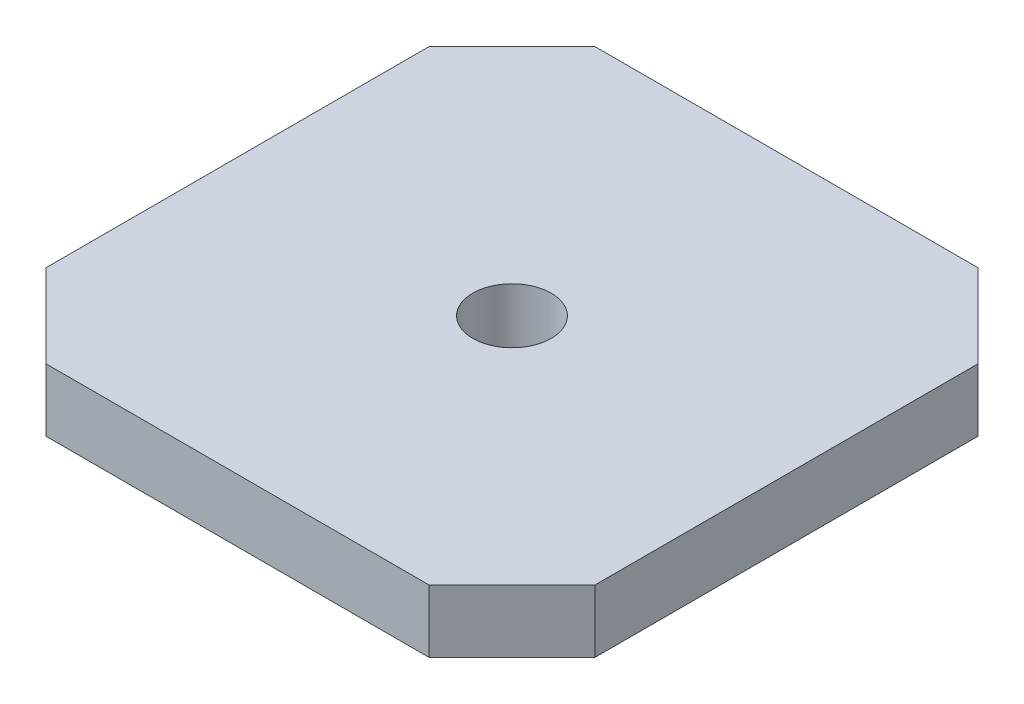
ISO-10303-21;
HEADER;
FILE_DESCRIPTION(('STEP AP214'),'2;1');
FILE_NAME('part.step','',(''),(''),'','','');
FILE_SCHEMA(('AUTOMOTIVE_DESIGN { 1 0 10303 214 1 1 1 1 }'));
ENDSEC;
DATA;
#1=APPLICATION_CONTEXT('core data for automotive mechanical design processes');
#2=APPLICATION_PROTOCOL_DEFINITION('international standard','automotive_design',2000,#1);
#3=PRODUCT_CONTEXT('',#1,'mechanical');
#4=PRODUCT('Part','Part','',(#3));
#5=PRODUCT_RELATED_PRODUCT_CATEGORY('part','',(#4));
#6=PRODUCT_DEFINITION_FORMATION('','',#4);
#7=PRODUCT_DEFINITION_CONTEXT('part definition',#1,'design');
#8=PRODUCT_DEFINITION('design','',#6,#7);
#9=PRODUCT_DEFINITION_SHAPE('','',#8);
#10=(LENGTH_UNIT() NAMED_UNIT(*) SI_UNIT(.MILLI.,.METRE.));
#11=(NAMED_UNIT(*) PLANE_ANGLE_UNIT() SI_UNIT($,.RADIAN.));
#12=(NAMED_UNIT(*) SI_UNIT($,.STERADIAN.) SOLID_ANGLE_UNIT());
#13=UNCERTAINTY_MEASURE_WITH_UNIT(LENGTH_MEASURE(1.E-05),#10,'distance_accuracy_value','');
#14=(GEOMETRIC_REPRESENTATION_CONTEXT(3) GLOBAL_UNCERTAINTY_ASSIGNED_CONTEXT((#13)) GLOBAL_UNIT_ASSIGNED_CONTEXT((#10,
#11,#12)) REPRESENTATION_CONTEXT('',''));
#15=CARTESIAN_POINT('',(0.,0.,0.));
#16=DIRECTION('',(0.,0.,1.));
#17=DIRECTION('',(1.,0.,0.));
#18=AXIS2_PLACEMENT_3D('',#15,#16,#17);
#19=CARTESIAN_POINT('',(0.,4.,0.));
#20=DIRECTION('',(1.,0.,0.));
#21=DIRECTION('',(0.,0.,-1.));
#22=AXIS2_PLACEMENT_3D('',#19,#20,#21);
#23=PLANE('',#22);
#24=DIRECTION('',(0.,1.,0.));
#25=VECTOR('',#24,1.);
#26=CARTESIAN_POINT('',(0.,-14.,-5.30151519016501));
#27=LINE('',#26,#25);
#28=CARTESIAN_POINT('',(0.,0.,-5.30151519016501));
#29=VERTEX_POINT('',#28);
#30=CARTESIAN_POINT('',(0.,4.,-5.30151519016501));
#31=VERTEX_POINT('',#30);
#32=EDGE_CURVE('E106',#29,#31,#27,.T.);
#33=ORIENTED_EDGE('',*,*,#32,.T.);
#34=DIRECTION('',(0.,0.,1.));
#35=VECTOR('',#34,1.);
#36=CARTESIAN_POINT('',(0.,4.,0.));
#37=LINE('',#36,#35);
#38=CARTESIAN_POINT('',(0.,4.,-29.698484809835));
#39=VERTEX_POINT('',#38);
#40=EDGE_CURVE('E115',#39,#31,#37,.T.);
#41=ORIENTED_EDGE('',*,*,#40,.F.);
#42=DIRECTION('',(0.,1.,0.));
#43=VECTOR('',#42,1.);
#44=CARTESIAN_POINT('',(0.,-14.,-29.698484809835));
#45=LINE('',#44,#43);
#46=CARTESIAN_POINT('',(0.,0.,-29.698484809835));
#47=VERTEX_POINT('',#46);
#48=EDGE_CURVE('E95',#47,#39,#45,.T.);
#49=ORIENTED_EDGE('',*,*,#48,.F.);
#50=DIRECTION('',(0.,0.,1.));
#51=VECTOR('',#50,1.);
#52=CARTESIAN_POINT('',(0.,0.,0.));
#53=LINE('',#52,#51);
#54=EDGE_CURVE('E136',#47,#29,#53,.T.);
#55=ORIENTED_EDGE('',*,*,#54,.T.);
#56=EDGE_LOOP('',(#33,#41,#49,#55));
#57=FACE_BOUND('',#56,.T.);
#58=ADVANCED_FACE('F33',(#57),#23,.F.);
#59=CARTESIAN_POINT('',(0.,4.,0.));
#60=DIRECTION('',(0.,0.,-1.));
#61=DIRECTION('',(-1.,0.,0.));
#62=AXIS2_PLACEMENT_3D('',#59,#60,#61);
#63=PLANE('',#62);
#64=DIRECTION('',(0.,1.,0.));
#65=VECTOR('',#64,1.);
#66=CARTESIAN_POINT('',(29.698484809835,-14.,0.));
#67=LINE('',#66,#65);
#68=CARTESIAN_POINT('',(29.698484809835,0.,0.));
#69=VERTEX_POINT('',#68);
#70=CARTESIAN_POINT('',(29.698484809835,4.,0.));
#71=VERTEX_POINT('',#70);
#72=EDGE_CURVE('E47',#69,#71,#67,.T.);
#73=ORIENTED_EDGE('',*,*,#72,.T.);
#74=DIRECTION('',(1.,0.,0.));
#75=VECTOR('',#74,1.);
#76=CARTESIAN_POINT('',(0.,4.,0.));
#77=LINE('',#76,#75);
#78=CARTESIAN_POINT('',(5.30151519016499,4.,0.));
#79=VERTEX_POINT('',#78);
#80=EDGE_CURVE('E122',#79,#71,#77,.T.);
#81=ORIENTED_EDGE('',*,*,#80,.F.);
#82=DIRECTION('',(0.,1.,0.));
#83=VECTOR('',#82,1.);
#84=CARTESIAN_POINT('',(5.30151519016499,-14.,0.));
#85=LINE('',#84,#83);
#86=CARTESIAN_POINT('',(5.30151519016499,0.,0.));
#87=VERTEX_POINT('',#86);
#88=EDGE_CURVE('E157',#87,#79,#85,.T.);
#89=ORIENTED_EDGE('',*,*,#88,.F.);
#90=DIRECTION('',(1.,0.,0.));
#91=VECTOR('',#90,1.);
#92=CARTESIAN_POINT('',(0.,0.,0.));
#93=LINE('',#92,#91);
#94=EDGE_CURVE('E138',#87,#69,#93,.T.);
#95=ORIENTED_EDGE('',*,*,#94,.T.);
#96=EDGE_LOOP('',(#73,#81,#89,#95));
#97=FACE_BOUND('',#96,.T.);
#98=ADVANCED_FACE('F155',(#97),#63,.F.);
#99=CARTESIAN_POINT('',(35.,4.,0.));
#100=DIRECTION('',(-1.,0.,0.));
#101=DIRECTION('',(0.,0.,1.));
#102=AXIS2_PLACEMENT_3D('',#99,#100,#101);
#103=PLANE('',#102);
#104=DIRECTION('',(0.,1.,0.));
#105=VECTOR('',#104,1.);
#106=CARTESIAN_POINT('',(35.,-14.,-29.698484809835));
#107=LINE('',#106,#105);
#108=CARTESIAN_POINT('',(35.,0.,-29.698484809835));
#109=VERTEX_POINT('',#108);
#110=CARTESIAN_POINT('',(35.,4.,-29.698484809835));
#111=VERTEX_POINT('',#110);
#112=EDGE_CURVE('E55',#109,#111,#107,.T.);
#113=ORIENTED_EDGE('',*,*,#112,.T.);
#114=DIRECTION('',(0.,0.,-1.));
#115=VECTOR('',#114,1.);
#116=CARTESIAN_POINT('',(35.,4.,0.));
#117=LINE('',#116,#115);
#118=CARTESIAN_POINT('',(35.,4.,-5.30151519016499));
#119=VERTEX_POINT('',#118);
#120=EDGE_CURVE('E126',#119,#111,#117,.T.);
#121=ORIENTED_EDGE('',*,*,#120,.F.);
#122=DIRECTION('',(0.,1.,0.));
#123=VECTOR('',#122,1.);
#124=CARTESIAN_POINT('',(35.,-14.,-5.30151519016499));
#125=LINE('',#124,#123);
#126=CARTESIAN_POINT('',(35.,0.,-5.30151519016499));
#127=VERTEX_POINT('',#126);
#128=EDGE_CURVE('E160',#127,#119,#125,.T.);
#129=ORIENTED_EDGE('',*,*,#128,.F.);
#130=DIRECTION('',(0.,0.,-1.));
#131=VECTOR('',#130,1.);
#132=CARTESIAN_POINT('',(35.,0.,0.));
#133=LINE('',#132,#131);
#134=EDGE_CURVE('E129',#127,#109,#133,.T.);
#135=ORIENTED_EDGE('',*,*,#134,.T.);
#136=EDGE_LOOP('',(#113,#121,#129,#135));
#137=FACE_BOUND('',#136,.T.);
#138=ADVANCED_FACE('F195',(#137),#103,.F.);
#139=CARTESIAN_POINT('',(0.,4.,-35.));
#140=DIRECTION('',(0.,0.,1.));
#141=DIRECTION('',(1.,0.,0.));
#142=AXIS2_PLACEMENT_3D('',#139,#140,#141);
#143=PLANE('',#142);
#144=DIRECTION('',(0.,1.,0.));
#145=VECTOR('',#144,1.);
#146=CARTESIAN_POINT('',(29.698484809835,-14.,-35.));
#147=LINE('',#146,#145);
#148=CARTESIAN_POINT('',(29.698484809835,0.,-35.));
#149=VERTEX_POINT('',#148);
#150=CARTESIAN_POINT('',(29.698484809835,4.,-35.));
#151=VERTEX_POINT('',#150);
#152=EDGE_CURVE('E139',#149,#151,#147,.T.);
#153=ORIENTED_EDGE('',*,*,#152,.F.);
#154=DIRECTION('',(-1.,0.,0.));
#155=VECTOR('',#154,1.);
#156=CARTESIAN_POINT('',(0.,0.,-35.));
#157=LINE('',#156,#155);
#158=CARTESIAN_POINT('',(5.30151519016502,0.,-35.));
#159=VERTEX_POINT('',#158);
#160=EDGE_CURVE('E123',#149,#159,#157,.T.);
#161=ORIENTED_EDGE('',*,*,#160,.T.);
#162=DIRECTION('',(0.,1.,0.));
#163=VECTOR('',#162,1.);
#164=CARTESIAN_POINT('',(5.30151519016501,-14.,-35.));
#165=LINE('',#164,#163);
#166=CARTESIAN_POINT('',(5.30151519016501,4.,-35.));
#167=VERTEX_POINT('',#166);
#168=EDGE_CURVE('E107',#159,#167,#165,.T.);
#169=ORIENTED_EDGE('',*,*,#168,.T.);
#170=DIRECTION('',(-1.,0.,0.));
#171=VECTOR('',#170,1.);
#172=CARTESIAN_POINT('',(0.,4.,-35.));
#173=LINE('',#172,#171);
#174=EDGE_CURVE('E117',#151,#167,#173,.T.);
#175=ORIENTED_EDGE('',*,*,#174,.F.);
#176=EDGE_LOOP('',(#153,#161,#169,#175));
#177=FACE_BOUND('',#176,.T.);
#178=ADVANCED_FACE('F188',(#177),#143,.F.);
#179=CARTESIAN_POINT('',(0.,4.,0.));
#180=DIRECTION('',(0.,-1.,0.));
#181=DIRECTION('',(0.,0.,-1.));
#182=AXIS2_PLACEMENT_3D('',#179,#180,#181);
#183=PLANE('',#182);
#184=CARTESIAN_POINT('',(17.5,4.,-17.5));
#185=DIRECTION('',(0.,1.,0.));
#186=DIRECTION('',(0.,0.,1.));
#187=AXIS2_PLACEMENT_3D('',#184,#185,#186);
#188=CIRCLE('',#187,2.5);
#189=CARTESIAN_POINT('',(17.5,4.,-15.));
#190=VERTEX_POINT('',#189);
#191=EDGE_CURVE('E173',#190,#190,#188,.T.);
#192=ORIENTED_EDGE('',*,*,#191,.F.);
#193=EDGE_LOOP('',(#192));
#194=FACE_BOUND('',#193,.T.);
#195=DIRECTION('',(-0.707106781186546,0.,-0.707106781186549));
#196=VECTOR('',#195,1.);
#197=CARTESIAN_POINT('',(35.,4.,-29.698484809835));
#198=LINE('',#197,#196);
#199=EDGE_CURVE('E167',#111,#151,#198,.T.);
#200=ORIENTED_EDGE('',*,*,#199,.T.);
#201=ORIENTED_EDGE('',*,*,#174,.T.);
#202=DIRECTION('',(-0.707106781186549,0.,0.707106781186546));
#203=VECTOR('',#202,1.);
#204=CARTESIAN_POINT('',(5.30151519016501,4.,-35.));
#205=LINE('',#204,#203);
#206=EDGE_CURVE('E98',#167,#39,#205,.T.);
#207=ORIENTED_EDGE('',*,*,#206,.T.);
#208=ORIENTED_EDGE('',*,*,#40,.T.);
#209=DIRECTION('',(0.707106781186546,0.,0.707106781186549));
#210=VECTOR('',#209,1.);
#211=CARTESIAN_POINT('',(0.,4.,-5.30151519016501));
#212=LINE('',#211,#210);
#213=EDGE_CURVE('E118',#31,#79,#212,.T.);
#214=ORIENTED_EDGE('',*,*,#213,.T.);
#215=ORIENTED_EDGE('',*,*,#80,.T.);
#216=DIRECTION('',(0.707106781186549,0.,-0.707106781186546));
#217=VECTOR('',#216,1.);
#218=CARTESIAN_POINT('',(29.698484809835,4.,0.));
#219=LINE('',#218,#217);
#220=EDGE_CURVE('E169',#71,#119,#219,.T.);
#221=ORIENTED_EDGE('',*,*,#220,.T.);
#222=ORIENTED_EDGE('',*,*,#120,.T.);
#223=EDGE_LOOP('',(#200,#201,#207,#208,#214,#215,#221,#222));
#224=FACE_BOUND('',#223,.T.);
#225=ADVANCED_FACE('F113',(#194,#224),#183,.F.);
#226=CARTESIAN_POINT('',(0.,0.,0.));
#227=DIRECTION('',(0.,-1.,0.));
#228=DIRECTION('',(0.,0.,-1.));
#229=AXIS2_PLACEMENT_3D('',#226,#227,#228);
#230=PLANE('',#229);
#231=CARTESIAN_POINT('',(17.5,0.,-17.5));
#232=DIRECTION('',(0.,1.,0.));
#233=DIRECTION('',(0.,0.,1.));
#234=AXIS2_PLACEMENT_3D('',#231,#232,#233);
#235=CIRCLE('',#234,2.5);
#236=CARTESIAN_POINT('',(17.5,0.,-15.));
#237=VERTEX_POINT('',#236);
#238=EDGE_CURVE('E119',#237,#237,#235,.T.);
#239=ORIENTED_EDGE('',*,*,#238,.T.);
#240=EDGE_LOOP('',(#239));
#241=FACE_BOUND('',#240,.T.);
#242=ORIENTED_EDGE('',*,*,#160,.F.);
#243=DIRECTION('',(0.707106781186546,0.,0.707106781186549));
#244=VECTOR('',#243,1.);
#245=CARTESIAN_POINT('',(32.3492424049176,0.,-32.3492424049174));
#246=LINE('',#245,#244);
#247=EDGE_CURVE('E12',#149,#109,#246,.T.);
#248=ORIENTED_EDGE('',*,*,#247,.T.);
#249=ORIENTED_EDGE('',*,*,#134,.F.);
#250=DIRECTION('',(-0.707106781186549,0.,0.707106781186546));
#251=VECTOR('',#250,1.);
#252=CARTESIAN_POINT('',(14.8492424049174,0.,14.8492424049175));
#253=LINE('',#252,#251);
#254=EDGE_CURVE('E40',#127,#69,#253,.T.);
#255=ORIENTED_EDGE('',*,*,#254,.T.);
#256=ORIENTED_EDGE('',*,*,#94,.F.);
#257=DIRECTION('',(-0.707106781186546,0.,-0.707106781186549));
#258=VECTOR('',#257,1.);
#259=CARTESIAN_POINT('',(2.65075759508251,0.,-2.6507575950825));
#260=LINE('',#259,#258);
#261=EDGE_CURVE('E145',#87,#29,#260,.T.);
#262=ORIENTED_EDGE('',*,*,#261,.T.);
#263=ORIENTED_EDGE('',*,*,#54,.F.);
#264=DIRECTION('',(0.707106781186549,0.,-0.707106781186546));
#265=VECTOR('',#264,1.);
#266=CARTESIAN_POINT('',(-14.8492424049175,0.,-14.8492424049176));
#267=LINE('',#266,#265);
#268=EDGE_CURVE('E101',#47,#159,#267,.T.);
#269=ORIENTED_EDGE('',*,*,#268,.T.);
#270=EDGE_LOOP('',(#242,#248,#249,#255,#256,#262,#263,#269));
#271=FACE_BOUND('',#270,.T.);
#272=ADVANCED_FACE('F151',(#241,#271),#230,.T.);
#273=CARTESIAN_POINT('',(5.30151519016501,-14.,-35.));
#274=DIRECTION('',(-0.707106781186546,0.,-0.707106781186549));
#275=DIRECTION('',(-0.707106781186549,0.,0.707106781186546));
#276=AXIS2_PLACEMENT_3D('',#273,#274,#275);
#277=PLANE('',#276);
#278=ORIENTED_EDGE('',*,*,#48,.T.);
#279=ORIENTED_EDGE('',*,*,#206,.F.);
#280=ORIENTED_EDGE('',*,*,#168,.F.);
#281=ORIENTED_EDGE('',*,*,#268,.F.);
#282=EDGE_LOOP('',(#278,#279,#280,#281));
#283=FACE_BOUND('',#282,.T.);
#284=ADVANCED_FACE('F97',(#283),#277,.T.);
#285=CARTESIAN_POINT('',(0.,-14.,-5.30151519016501));
#286=DIRECTION('',(-0.707106781186549,0.,0.707106781186546));
#287=DIRECTION('',(0.707106781186546,0.,0.707106781186549));
#288=AXIS2_PLACEMENT_3D('',#285,#286,#287);
#289=PLANE('',#288);
#290=ORIENTED_EDGE('',*,*,#88,.T.);
#291=ORIENTED_EDGE('',*,*,#213,.F.);
#292=ORIENTED_EDGE('',*,*,#32,.F.);
#293=ORIENTED_EDGE('',*,*,#261,.F.);
#294=EDGE_LOOP('',(#290,#291,#292,#293));
#295=FACE_BOUND('',#294,.T.);
#296=ADVANCED_FACE('F213',(#295),#289,.T.);
#297=CARTESIAN_POINT('',(29.698484809835,-14.,0.));
#298=DIRECTION('',(0.707106781186546,0.,0.707106781186549));
#299=DIRECTION('',(0.707106781186549,0.,-0.707106781186546));
#300=AXIS2_PLACEMENT_3D('',#297,#298,#299);
#301=PLANE('',#300);
#302=ORIENTED_EDGE('',*,*,#128,.T.);
#303=ORIENTED_EDGE('',*,*,#220,.F.);
#304=ORIENTED_EDGE('',*,*,#72,.F.);
#305=ORIENTED_EDGE('',*,*,#254,.F.);
#306=EDGE_LOOP('',(#302,#303,#304,#305));
#307=FACE_BOUND('',#306,.T.);
#308=ADVANCED_FACE('F211',(#307),#301,.T.);
#309=CARTESIAN_POINT('',(35.,-14.,-29.698484809835));
#310=DIRECTION('',(0.707106781186549,0.,-0.707106781186546));
#311=DIRECTION('',(-0.707106781186546,0.,-0.707106781186549));
#312=AXIS2_PLACEMENT_3D('',#309,#310,#311);
#313=PLANE('',#312);
#314=ORIENTED_EDGE('',*,*,#152,.T.);
#315=ORIENTED_EDGE('',*,*,#199,.F.);
#316=ORIENTED_EDGE('',*,*,#112,.F.);
#317=ORIENTED_EDGE('',*,*,#247,.F.);
#318=EDGE_LOOP('',(#314,#315,#316,#317));
#319=FACE_BOUND('',#318,.T.);
#320=ADVANCED_FACE('F183',(#319),#313,.T.);
#321=CARTESIAN_POINT('',(17.5,0.,-17.5));
#322=DIRECTION('',(0.,1.,0.));
#323=DIRECTION('',(0.,0.,1.));
#324=AXIS2_PLACEMENT_3D('',#321,#322,#323);
#325=CYLINDRICAL_SURFACE('',#324,2.5);
#326=ORIENTED_EDGE('',*,*,#238,.F.);
#327=EDGE_LOOP('',(#326));
#328=FACE_BOUND('',#327,.T.);
#329=ORIENTED_EDGE('',*,*,#191,.T.);
#330=EDGE_LOOP('',(#329));
#331=FACE_BOUND('',#330,.T.);
#332=ADVANCED_FACE('F180',(#328,#331),#325,.F.);
#333=CLOSED_SHELL('',(#58,#98,#138,#178,#225,#272,#284,#296,#308,#320,#332));
#334=MANIFOLD_SOLID_BREP('B2',#333);
#335=ADVANCED_BREP_SHAPE_REPRESENTATION('',(#18,#334),#14);
#336=SHAPE_DEFINITION_REPRESENTATION(#9,#335);
ENDSEC;
END-ISO-10303-21;
